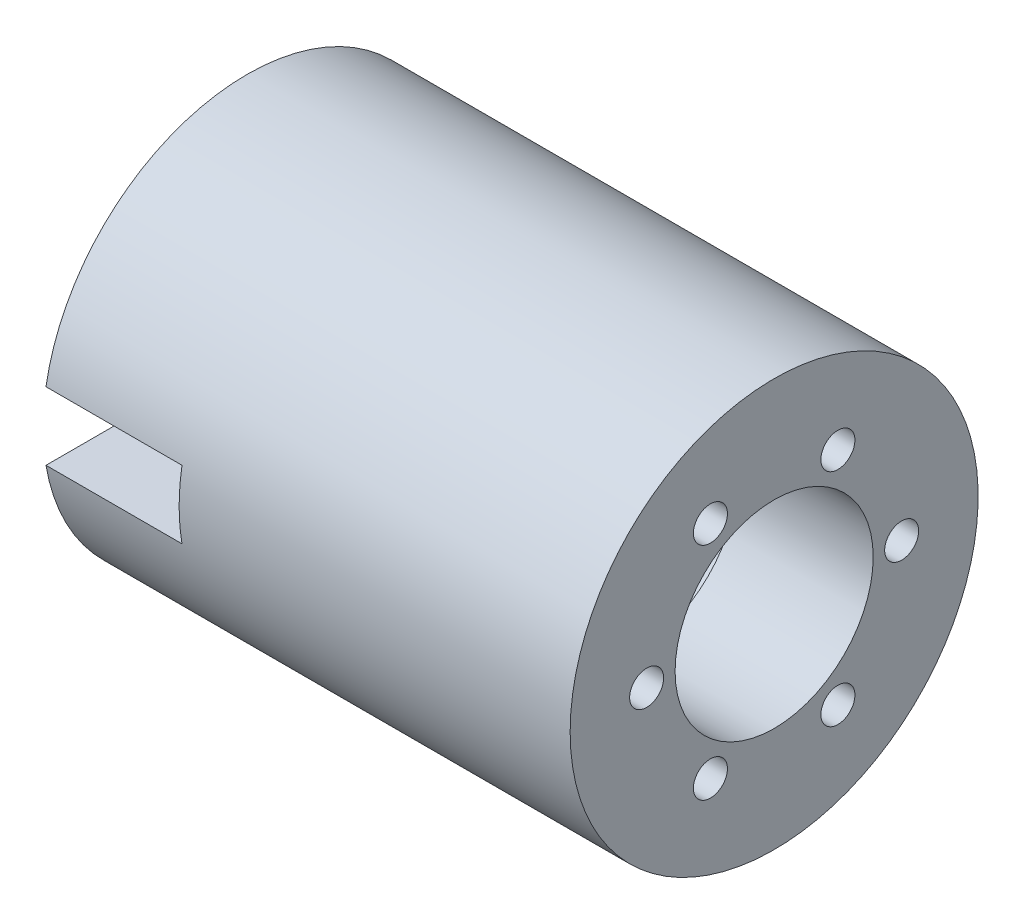
ISO-10303-21;
HEADER;
FILE_DESCRIPTION(('STEP AP214'),'2;1');
FILE_NAME('part.step','',(''),(''),'','','');
FILE_SCHEMA(('AUTOMOTIVE_DESIGN { 1 0 10303 214 1 1 1 1 }'));
ENDSEC;
DATA;
#1=APPLICATION_CONTEXT('core data for automotive mechanical design processes');
#2=APPLICATION_PROTOCOL_DEFINITION('international standard','automotive_design',2000,#1);
#3=PRODUCT_CONTEXT('',#1,'mechanical');
#4=PRODUCT('Part','Part','',(#3));
#5=PRODUCT_RELATED_PRODUCT_CATEGORY('part','',(#4));
#6=PRODUCT_DEFINITION_FORMATION('','',#4);
#7=PRODUCT_DEFINITION_CONTEXT('part definition',#1,'design');
#8=PRODUCT_DEFINITION('design','',#6,#7);
#9=PRODUCT_DEFINITION_SHAPE('','',#8);
#10=(LENGTH_UNIT() NAMED_UNIT(*) SI_UNIT(.MILLI.,.METRE.));
#11=(NAMED_UNIT(*) PLANE_ANGLE_UNIT() SI_UNIT($,.RADIAN.));
#12=(NAMED_UNIT(*) SI_UNIT($,.STERADIAN.) SOLID_ANGLE_UNIT());
#13=UNCERTAINTY_MEASURE_WITH_UNIT(LENGTH_MEASURE(1.E-05),#10,'distance_accuracy_value','');
#14=(GEOMETRIC_REPRESENTATION_CONTEXT(3) GLOBAL_UNCERTAINTY_ASSIGNED_CONTEXT((#13)) GLOBAL_UNIT_ASSIGNED_CONTEXT((#10,
#11,#12)) REPRESENTATION_CONTEXT('',''));
#15=CARTESIAN_POINT('',(0.,0.,0.));
#16=DIRECTION('',(0.,0.,1.));
#17=DIRECTION('',(1.,0.,0.));
#18=AXIS2_PLACEMENT_3D('',#15,#16,#17);
#19=CARTESIAN_POINT('',(-49.2125,0.,0.));
#20=DIRECTION('',(-1.,0.,0.));
#21=DIRECTION('',(0.,0.,1.));
#22=AXIS2_PLACEMENT_3D('',#19,#20,#21);
#23=CYLINDRICAL_SURFACE('',#22,38.1);
#24=CARTESIAN_POINT('',(49.2125,0.,0.));
#25=DIRECTION('',(-1.,0.,0.));
#26=DIRECTION('',(0.,0.,1.));
#27=AXIS2_PLACEMENT_3D('',#24,#25,#26);
#28=CIRCLE('',#27,38.1);
#29=CARTESIAN_POINT('',(49.2125,0.,38.1));
#30=VERTEX_POINT('',#29);
#31=EDGE_CURVE('E599',#30,#30,#28,.T.);
#32=ORIENTED_EDGE('',*,*,#31,.T.);
#33=EDGE_LOOP('',(#32));
#34=FACE_BOUND('',#33,.T.);
#35=CARTESIAN_POINT('',(-49.2125,0.,0.));
#36=DIRECTION('',(-1.,0.,0.));
#37=DIRECTION('',(0.,0.,1.));
#38=AXIS2_PLACEMENT_3D('',#35,#36,#37);
#39=CIRCLE('',#38,38.1);
#40=CARTESIAN_POINT('',(-49.2125,6.35,37.5671066226826));
#41=VERTEX_POINT('',#40);
#42=CARTESIAN_POINT('',(-49.2125,-6.35,37.5671066226826));
#43=VERTEX_POINT('',#42);
#44=EDGE_CURVE('E551',#41,#43,#39,.T.);
#45=ORIENTED_EDGE('',*,*,#44,.F.);
#46=DIRECTION('',(-1.,0.,0.));
#47=VECTOR('',#46,1.);
#48=CARTESIAN_POINT('',(-49.2125,6.35,37.5671066226826));
#49=LINE('',#48,#47);
#50=CARTESIAN_POINT('',(-23.8125,6.35,37.5671066226826));
#51=VERTEX_POINT('',#50);
#52=EDGE_CURVE('E544',#41,#51,#49,.F.);
#53=ORIENTED_EDGE('',*,*,#52,.T.);
#54=CARTESIAN_POINT('',(-23.8125,0.,0.));
#55=DIRECTION('',(-1.,0.,0.));
#56=DIRECTION('',(0.,-1.,0.));
#57=AXIS2_PLACEMENT_3D('',#54,#55,#56);
#58=CIRCLE('',#57,38.1);
#59=CARTESIAN_POINT('',(-23.8125,-6.34999999999998,37.5671066226826));
#60=VERTEX_POINT('',#59);
#61=EDGE_CURVE('E531',#51,#60,#58,.F.);
#62=ORIENTED_EDGE('',*,*,#61,.T.);
#63=DIRECTION('',(-1.,0.,0.));
#64=VECTOR('',#63,1.);
#65=CARTESIAN_POINT('',(-49.2125,-6.35,37.5671066226826));
#66=LINE('',#65,#64);
#67=EDGE_CURVE('E539',#60,#43,#66,.T.);
#68=ORIENTED_EDGE('',*,*,#67,.T.);
#69=EDGE_LOOP('',(#45,#53,#62,#68));
#70=FACE_BOUND('',#69,.T.);
#71=ADVANCED_FACE('F458',(#34,#70),#23,.T.);
#72=CARTESIAN_POINT('',(-49.2125,0.,0.));
#73=DIRECTION('',(-1.,0.,0.));
#74=DIRECTION('',(0.,0.,1.));
#75=AXIS2_PLACEMENT_3D('',#72,#73,#74);
#76=PLANE('',#75);
#77=CARTESIAN_POINT('',(-49.2125,0.,0.));
#78=DIRECTION('',(-1.,0.,0.));
#79=DIRECTION('',(0.,0.,1.));
#80=AXIS2_PLACEMENT_3D('',#77,#78,#79);
#81=CIRCLE('',#80,21.2725);
#82=CARTESIAN_POINT('',(-49.2125,6.35,20.3026292940102));
#83=VERTEX_POINT('',#82);
#84=CARTESIAN_POINT('',(-49.2125,-6.35,20.3026292940102));
#85=VERTEX_POINT('',#84);
#86=EDGE_CURVE('E609',#83,#85,#81,.T.);
#87=ORIENTED_EDGE('',*,*,#86,.F.);
#88=DIRECTION('',(0.,0.,-1.));
#89=VECTOR('',#88,1.);
#90=CARTESIAN_POINT('',(-49.2125,6.35,38.1));
#91=LINE('',#90,#89);
#92=EDGE_CURVE('E540',#41,#83,#91,.T.);
#93=ORIENTED_EDGE('',*,*,#92,.F.);
#94=ORIENTED_EDGE('',*,*,#44,.T.);
#95=DIRECTION('',(0.,0.,-1.));
#96=VECTOR('',#95,1.);
#97=CARTESIAN_POINT('',(-49.2125,-6.35,38.1));
#98=LINE('',#97,#96);
#99=EDGE_CURVE('E619',#43,#85,#98,.T.);
#100=ORIENTED_EDGE('',*,*,#99,.T.);
#101=EDGE_LOOP('',(#87,#93,#94,#100));
#102=FACE_BOUND('',#101,.T.);
#103=ADVANCED_FACE('F623',(#102),#76,.T.);
#104=CARTESIAN_POINT('',(-49.2125,0.,0.));
#105=DIRECTION('',(-1.,0.,0.));
#106=DIRECTION('',(0.,0.,1.));
#107=AXIS2_PLACEMENT_3D('',#104,#105,#106);
#108=CYLINDRICAL_SURFACE('',#107,21.2725);
#109=CARTESIAN_POINT('',(23.8125,0.,0.));
#110=DIRECTION('',(-1.,0.,0.));
#111=DIRECTION('',(0.,0.,1.));
#112=AXIS2_PLACEMENT_3D('',#109,#110,#111);
#113=CIRCLE('',#112,21.2725);
#114=CARTESIAN_POINT('',(23.8125,17.4570729607871,12.1560626804799));
#115=VERTEX_POINT('',#114);
#116=CARTESIAN_POINT('',(23.8125,19.2559955716851,9.04023731952017));
#117=VERTEX_POINT('',#116);
#118=EDGE_CURVE('E606',#115,#117,#113,.T.);
#119=ORIENTED_EDGE('',*,*,#118,.F.);
#120=CARTESIAN_POINT('',(23.8125,1.79892261089789,21.1963));
#121=VERTEX_POINT('',#120);
#122=EDGE_CURVE('E605',#121,#115,#113,.T.);
#123=ORIENTED_EDGE('',*,*,#122,.F.);
#124=CARTESIAN_POINT('',(23.8125,-1.79892261089803,21.1963));
#125=VERTEX_POINT('',#124);
#126=EDGE_CURVE('E892',#125,#121,#113,.T.);
#127=ORIENTED_EDGE('',*,*,#126,.F.);
#128=CARTESIAN_POINT('',(23.8125,-17.4570729607872,12.1560626804798));
#129=VERTEX_POINT('',#128);
#130=EDGE_CURVE('E896',#129,#125,#113,.T.);
#131=ORIENTED_EDGE('',*,*,#130,.F.);
#132=CARTESIAN_POINT('',(23.8125,-19.2559955716851,9.04023731952018));
#133=VERTEX_POINT('',#132);
#134=EDGE_CURVE('E929',#133,#129,#113,.T.);
#135=ORIENTED_EDGE('',*,*,#134,.F.);
#136=CARTESIAN_POINT('',(23.8125,-19.2559955716851,-9.04023731952019));
#137=VERTEX_POINT('',#136);
#138=EDGE_CURVE('E926',#137,#133,#113,.T.);
#139=ORIENTED_EDGE('',*,*,#138,.F.);
#140=CARTESIAN_POINT('',(23.8125,-17.4570729607871,-12.1560626804798));
#141=VERTEX_POINT('',#140);
#142=EDGE_CURVE('E923',#141,#137,#113,.T.);
#143=ORIENTED_EDGE('',*,*,#142,.F.);
#144=CARTESIAN_POINT('',(23.8125,-1.79892261089791,-21.1963));
#145=VERTEX_POINT('',#144);
#146=EDGE_CURVE('E920',#145,#141,#113,.T.);
#147=ORIENTED_EDGE('',*,*,#146,.F.);
#148=CARTESIAN_POINT('',(23.8125,1.79892261089791,-21.1963));
#149=VERTEX_POINT('',#148);
#150=EDGE_CURVE('E918',#149,#145,#113,.T.);
#151=ORIENTED_EDGE('',*,*,#150,.F.);
#152=CARTESIAN_POINT('',(23.8125,17.4570729607871,-12.15606268048));
#153=VERTEX_POINT('',#152);
#154=EDGE_CURVE('E917',#153,#149,#113,.T.);
#155=ORIENTED_EDGE('',*,*,#154,.F.);
#156=CARTESIAN_POINT('',(23.8125,19.2559955716851,-9.04023731952007));
#157=VERTEX_POINT('',#156);
#158=EDGE_CURVE('E915',#157,#153,#113,.T.);
#159=ORIENTED_EDGE('',*,*,#158,.F.);
#160=EDGE_CURVE('E610',#117,#157,#113,.T.);
#161=ORIENTED_EDGE('',*,*,#160,.F.);
#162=EDGE_LOOP('',(#119,#123,#127,#131,#135,#139,#143,#147,#151,#155,#159,#161));
#163=FACE_BOUND('',#162,.T.);
#164=DIRECTION('',(-1.,0.,0.));
#165=VECTOR('',#164,1.);
#166=CARTESIAN_POINT('',(-49.2125,6.35,20.3026292940102));
#167=LINE('',#166,#165);
#168=CARTESIAN_POINT('',(-23.8125,6.35,20.3026292940102));
#169=VERTEX_POINT('',#168);
#170=EDGE_CURVE('E12',#83,#169,#167,.F.);
#171=ORIENTED_EDGE('',*,*,#170,.F.);
#172=ORIENTED_EDGE('',*,*,#86,.T.);
#173=DIRECTION('',(-1.,0.,0.));
#174=VECTOR('',#173,1.);
#175=CARTESIAN_POINT('',(-49.2125,-6.35,20.3026292940102));
#176=LINE('',#175,#174);
#177=CARTESIAN_POINT('',(-23.8125,-6.34999999999998,20.3026292940102));
#178=VERTEX_POINT('',#177);
#179=EDGE_CURVE('E465',#178,#85,#176,.T.);
#180=ORIENTED_EDGE('',*,*,#179,.F.);
#181=CARTESIAN_POINT('',(-23.8125,0.,0.));
#182=DIRECTION('',(-1.,0.,0.));
#183=DIRECTION('',(0.,-1.,0.));
#184=AXIS2_PLACEMENT_3D('',#181,#182,#183);
#185=CIRCLE('',#184,21.2725);
#186=EDGE_CURVE('E614',#169,#178,#185,.F.);
#187=ORIENTED_EDGE('',*,*,#186,.F.);
#188=EDGE_LOOP('',(#171,#172,#180,#187));
#189=FACE_BOUND('',#188,.T.);
#190=ADVANCED_FACE('F625',(#163,#189),#108,.F.);
#191=CARTESIAN_POINT('',(23.8125,0.,0.));
#192=DIRECTION('',(1.,0.,0.));
#193=DIRECTION('',(0.,0.,-1.));
#194=AXIS2_PLACEMENT_3D('',#191,#192,#193);
#195=PLANE('',#194);
#196=CARTESIAN_POINT('',(23.8125,0.,0.));
#197=DIRECTION('',(1.,0.,0.));
#198=DIRECTION('',(0.,0.,-1.));
#199=AXIS2_PLACEMENT_3D('',#196,#197,#198);
#200=CIRCLE('',#199,18.5);
#201=CARTESIAN_POINT('',(23.8125,0.,-18.5));
#202=VERTEX_POINT('',#201);
#203=EDGE_CURVE('E560',#202,#202,#200,.T.);
#204=ORIENTED_EDGE('',*,*,#203,.T.);
#205=EDGE_LOOP('',(#204));
#206=FACE_BOUND('',#205,.T.);
#207=ORIENTED_EDGE('',*,*,#130,.T.);
#208=CARTESIAN_POINT('',(23.8125,0.,23.8125));
#209=DIRECTION('',(1.,0.,0.));
#210=DIRECTION('',(0.,0.86602540378444,-0.499999999999998));
#211=AXIS2_PLACEMENT_3D('',#208,#209,#210);
#212=CIRCLE('',#211,3.17499999999997);
#213=EDGE_CURVE('E558',#125,#121,#212,.T.);
#214=ORIENTED_EDGE('',*,*,#213,.T.);
#215=ORIENTED_EDGE('',*,*,#122,.T.);
#216=CARTESIAN_POINT('',(23.8125,20.6222299276169,11.90625));
#217=DIRECTION('',(1.,0.,0.));
#218=DIRECTION('',(0.,0.,-1.));
#219=AXIS2_PLACEMENT_3D('',#216,#217,#218);
#220=CIRCLE('',#219,3.17499999999997);
#221=EDGE_CURVE('E593',#115,#117,#220,.T.);
#222=ORIENTED_EDGE('',*,*,#221,.T.);
#223=ORIENTED_EDGE('',*,*,#160,.T.);
#224=CARTESIAN_POINT('',(23.8125,20.6222299276169,-11.90625));
#225=DIRECTION('',(1.,0.,0.));
#226=DIRECTION('',(0.,0.,-1.));
#227=AXIS2_PLACEMENT_3D('',#224,#225,#226);
#228=CIRCLE('',#227,3.17500000000002);
#229=EDGE_CURVE('E586',#157,#153,#228,.T.);
#230=ORIENTED_EDGE('',*,*,#229,.T.);
#231=ORIENTED_EDGE('',*,*,#154,.T.);
#232=CARTESIAN_POINT('',(23.8125,0.,-23.8125));
#233=DIRECTION('',(1.,0.,0.));
#234=DIRECTION('',(0.,0.,-1.));
#235=AXIS2_PLACEMENT_3D('',#232,#233,#234);
#236=CIRCLE('',#235,3.17499999999997);
#237=EDGE_CURVE('E579',#149,#145,#236,.T.);
#238=ORIENTED_EDGE('',*,*,#237,.T.);
#239=ORIENTED_EDGE('',*,*,#146,.T.);
#240=CARTESIAN_POINT('',(23.8125,-20.6222299276169,-11.90625));
#241=DIRECTION('',(1.,0.,0.));
#242=DIRECTION('',(0.,0.,-1.));
#243=AXIS2_PLACEMENT_3D('',#240,#241,#242);
#244=CIRCLE('',#243,3.17499999999997);
#245=EDGE_CURVE('E572',#141,#137,#244,.T.);
#246=ORIENTED_EDGE('',*,*,#245,.T.);
#247=ORIENTED_EDGE('',*,*,#138,.T.);
#248=CARTESIAN_POINT('',(23.8125,-20.6222299276169,11.90625));
#249=DIRECTION('',(1.,0.,0.));
#250=DIRECTION('',(0.,0.,-1.));
#251=AXIS2_PLACEMENT_3D('',#248,#249,#250);
#252=CIRCLE('',#251,3.17499999999997);
#253=EDGE_CURVE('E596',#133,#129,#252,.T.);
#254=ORIENTED_EDGE('',*,*,#253,.T.);
#255=EDGE_LOOP('',(#207,#214,#215,#222,#223,#230,#231,#238,#239,#246,#247,#254));
#256=FACE_BOUND('',#255,.T.);
#257=ADVANCED_FACE('F627',(#206,#256),#195,.F.);
#258=CARTESIAN_POINT('',(49.2125,0.,0.));
#259=DIRECTION('',(1.,0.,0.));
#260=DIRECTION('',(0.,0.,-1.));
#261=AXIS2_PLACEMENT_3D('',#258,#259,#260);
#262=PLANE('',#261);
#263=CARTESIAN_POINT('',(49.2125,0.,23.8125));
#264=DIRECTION('',(1.,0.,0.));
#265=DIRECTION('',(0.,0.86602540378444,-0.499999999999998));
#266=AXIS2_PLACEMENT_3D('',#263,#264,#265);
#267=CIRCLE('',#266,3.17499999999997);
#268=CARTESIAN_POINT('',(49.2125,2.7496306570155,22.225));
#269=VERTEX_POINT('',#268);
#270=EDGE_CURVE('E552',#269,#269,#267,.T.);
#271=ORIENTED_EDGE('',*,*,#270,.F.);
#272=EDGE_LOOP('',(#271));
#273=FACE_BOUND('',#272,.T.);
#274=CARTESIAN_POINT('',(49.2125,-20.6222299276169,-11.90625));
#275=DIRECTION('',(1.,0.,0.));
#276=DIRECTION('',(0.,0.,-1.));
#277=AXIS2_PLACEMENT_3D('',#274,#275,#276);
#278=CIRCLE('',#277,3.17499999999997);
#279=CARTESIAN_POINT('',(49.2125,-20.6222299276169,-15.08125));
#280=VERTEX_POINT('',#279);
#281=EDGE_CURVE('E568',#280,#280,#278,.T.);
#282=ORIENTED_EDGE('',*,*,#281,.F.);
#283=EDGE_LOOP('',(#282));
#284=FACE_BOUND('',#283,.T.);
#285=CARTESIAN_POINT('',(49.2125,0.,-23.8125));
#286=DIRECTION('',(1.,0.,0.));
#287=DIRECTION('',(0.,0.,-1.));
#288=AXIS2_PLACEMENT_3D('',#285,#286,#287);
#289=CIRCLE('',#288,3.17499999999997);
#290=CARTESIAN_POINT('',(49.2125,0.,-26.9875));
#291=VERTEX_POINT('',#290);
#292=EDGE_CURVE('E576',#291,#291,#289,.T.);
#293=ORIENTED_EDGE('',*,*,#292,.F.);
#294=EDGE_LOOP('',(#293));
#295=FACE_BOUND('',#294,.T.);
#296=CARTESIAN_POINT('',(49.2125,20.6222299276169,-11.90625));
#297=DIRECTION('',(1.,0.,0.));
#298=DIRECTION('',(0.,0.,-1.));
#299=AXIS2_PLACEMENT_3D('',#296,#297,#298);
#300=CIRCLE('',#299,3.17500000000002);
#301=CARTESIAN_POINT('',(49.2125,20.6222299276169,-15.08125));
#302=VERTEX_POINT('',#301);
#303=EDGE_CURVE('E583',#302,#302,#300,.T.);
#304=ORIENTED_EDGE('',*,*,#303,.F.);
#305=EDGE_LOOP('',(#304));
#306=FACE_BOUND('',#305,.T.);
#307=CARTESIAN_POINT('',(49.2125,20.6222299276169,11.90625));
#308=DIRECTION('',(1.,0.,0.));
#309=DIRECTION('',(0.,0.,-1.));
#310=AXIS2_PLACEMENT_3D('',#307,#308,#309);
#311=CIRCLE('',#310,3.17499999999997);
#312=CARTESIAN_POINT('',(49.2125,20.6222299276169,8.73125000000004));
#313=VERTEX_POINT('',#312);
#314=EDGE_CURVE('E590',#313,#313,#311,.T.);
#315=ORIENTED_EDGE('',*,*,#314,.F.);
#316=EDGE_LOOP('',(#315));
#317=FACE_BOUND('',#316,.T.);
#318=CARTESIAN_POINT('',(49.2125,0.,0.));
#319=DIRECTION('',(1.,0.,0.));
#320=DIRECTION('',(0.,0.,-1.));
#321=AXIS2_PLACEMENT_3D('',#318,#319,#320);
#322=CIRCLE('',#321,18.5);
#323=CARTESIAN_POINT('',(49.2125,0.,-18.5));
#324=VERTEX_POINT('',#323);
#325=EDGE_CURVE('E562',#324,#324,#322,.T.);
#326=ORIENTED_EDGE('',*,*,#325,.F.);
#327=EDGE_LOOP('',(#326));
#328=FACE_BOUND('',#327,.T.);
#329=CARTESIAN_POINT('',(49.2125,-20.6222299276169,11.90625));
#330=DIRECTION('',(1.,0.,0.));
#331=DIRECTION('',(0.,0.,-1.));
#332=AXIS2_PLACEMENT_3D('',#329,#330,#331);
#333=CIRCLE('',#332,3.17499999999997);
#334=CARTESIAN_POINT('',(49.2125,-20.6222299276169,8.73125000000004));
#335=VERTEX_POINT('',#334);
#336=EDGE_CURVE('E571',#335,#335,#333,.T.);
#337=ORIENTED_EDGE('',*,*,#336,.F.);
#338=EDGE_LOOP('',(#337));
#339=FACE_BOUND('',#338,.T.);
#340=ORIENTED_EDGE('',*,*,#31,.F.);
#341=EDGE_LOOP('',(#340));
#342=FACE_BOUND('',#341,.T.);
#343=ADVANCED_FACE('F634',(#273,#284,#295,#306,#317,#328,#339,#342),#262,.T.);
#344=CARTESIAN_POINT('',(23.8125,0.,0.));
#345=DIRECTION('',(1.,0.,0.));
#346=DIRECTION('',(0.,0.,-1.));
#347=AXIS2_PLACEMENT_3D('',#344,#345,#346);
#348=PLANE('',#347);
#349=ORIENTED_EDGE('',*,*,#134,.T.);
#350=EDGE_CURVE('E600',#129,#133,#252,.T.);
#351=ORIENTED_EDGE('',*,*,#350,.T.);
#352=EDGE_LOOP('',(#349,#351));
#353=FACE_BOUND('',#352,.T.);
#354=ADVANCED_FACE('F645',(#353),#348,.T.);
#355=CARTESIAN_POINT('',(23.8125,-20.6222299276169,11.90625));
#356=DIRECTION('',(1.,0.,0.));
#357=DIRECTION('',(0.,0.,-1.));
#358=AXIS2_PLACEMENT_3D('',#355,#356,#357);
#359=CYLINDRICAL_SURFACE('',#358,3.17499999999997);
#360=ORIENTED_EDGE('',*,*,#253,.F.);
#361=ORIENTED_EDGE('',*,*,#350,.F.);
#362=EDGE_LOOP('',(#360,#361));
#363=FACE_BOUND('',#362,.T.);
#364=ORIENTED_EDGE('',*,*,#336,.T.);
#365=EDGE_LOOP('',(#364));
#366=FACE_BOUND('',#365,.T.);
#367=ADVANCED_FACE('F651',(#363,#366),#359,.F.);
#368=CARTESIAN_POINT('',(23.8125,0.,0.));
#369=DIRECTION('',(1.,0.,0.));
#370=DIRECTION('',(0.,0.,-1.));
#371=AXIS2_PLACEMENT_3D('',#368,#369,#370);
#372=CYLINDRICAL_SURFACE('',#371,18.5);
#373=ORIENTED_EDGE('',*,*,#203,.F.);
#374=EDGE_LOOP('',(#373));
#375=FACE_BOUND('',#374,.T.);
#376=ORIENTED_EDGE('',*,*,#325,.T.);
#377=EDGE_LOOP('',(#376));
#378=FACE_BOUND('',#377,.T.);
#379=ADVANCED_FACE('F658',(#375,#378),#372,.F.);
#380=CARTESIAN_POINT('',(23.8125,0.,0.));
#381=DIRECTION('',(1.,0.,0.));
#382=DIRECTION('',(0.,0.,-1.));
#383=AXIS2_PLACEMENT_3D('',#380,#381,#382);
#384=PLANE('',#383);
#385=ORIENTED_EDGE('',*,*,#118,.T.);
#386=EDGE_CURVE('E565',#117,#115,#220,.T.);
#387=ORIENTED_EDGE('',*,*,#386,.T.);
#388=EDGE_LOOP('',(#385,#387));
#389=FACE_BOUND('',#388,.T.);
#390=ADVANCED_FACE('F661',(#389),#384,.T.);
#391=CARTESIAN_POINT('',(23.8125,20.6222299276169,11.90625));
#392=DIRECTION('',(1.,0.,0.));
#393=DIRECTION('',(0.,0.,-1.));
#394=AXIS2_PLACEMENT_3D('',#391,#392,#393);
#395=CYLINDRICAL_SURFACE('',#394,3.17499999999997);
#396=ORIENTED_EDGE('',*,*,#221,.F.);
#397=ORIENTED_EDGE('',*,*,#386,.F.);
#398=EDGE_LOOP('',(#396,#397));
#399=FACE_BOUND('',#398,.T.);
#400=ORIENTED_EDGE('',*,*,#314,.T.);
#401=EDGE_LOOP('',(#400));
#402=FACE_BOUND('',#401,.T.);
#403=ADVANCED_FACE('F664',(#399,#402),#395,.F.);
#404=CARTESIAN_POINT('',(23.8125,0.,0.));
#405=DIRECTION('',(1.,0.,0.));
#406=DIRECTION('',(0.,0.,-1.));
#407=AXIS2_PLACEMENT_3D('',#404,#405,#406);
#408=PLANE('',#407);
#409=ORIENTED_EDGE('',*,*,#158,.T.);
#410=EDGE_CURVE('E589',#153,#157,#228,.T.);
#411=ORIENTED_EDGE('',*,*,#410,.T.);
#412=EDGE_LOOP('',(#409,#411));
#413=FACE_BOUND('',#412,.T.);
#414=ADVANCED_FACE('F668',(#413),#408,.T.);
#415=CARTESIAN_POINT('',(23.8125,20.6222299276169,-11.90625));
#416=DIRECTION('',(1.,0.,0.));
#417=DIRECTION('',(0.,0.,-1.));
#418=AXIS2_PLACEMENT_3D('',#415,#416,#417);
#419=CYLINDRICAL_SURFACE('',#418,3.17500000000002);
#420=ORIENTED_EDGE('',*,*,#229,.F.);
#421=ORIENTED_EDGE('',*,*,#410,.F.);
#422=EDGE_LOOP('',(#420,#421));
#423=FACE_BOUND('',#422,.T.);
#424=ORIENTED_EDGE('',*,*,#303,.T.);
#425=EDGE_LOOP('',(#424));
#426=FACE_BOUND('',#425,.T.);
#427=ADVANCED_FACE('F672',(#423,#426),#419,.F.);
#428=CARTESIAN_POINT('',(23.8125,0.,0.));
#429=DIRECTION('',(1.,0.,0.));
#430=DIRECTION('',(0.,0.,-1.));
#431=AXIS2_PLACEMENT_3D('',#428,#429,#430);
#432=PLANE('',#431);
#433=ORIENTED_EDGE('',*,*,#150,.T.);
#434=EDGE_CURVE('E582',#145,#149,#236,.T.);
#435=ORIENTED_EDGE('',*,*,#434,.T.);
#436=EDGE_LOOP('',(#433,#435));
#437=FACE_BOUND('',#436,.T.);
#438=ADVANCED_FACE('F676',(#437),#432,.T.);
#439=CARTESIAN_POINT('',(23.8125,0.,-23.8125));
#440=DIRECTION('',(1.,0.,0.));
#441=DIRECTION('',(0.,0.,-1.));
#442=AXIS2_PLACEMENT_3D('',#439,#440,#441);
#443=CYLINDRICAL_SURFACE('',#442,3.17499999999997);
#444=ORIENTED_EDGE('',*,*,#237,.F.);
#445=ORIENTED_EDGE('',*,*,#434,.F.);
#446=EDGE_LOOP('',(#444,#445));
#447=FACE_BOUND('',#446,.T.);
#448=ORIENTED_EDGE('',*,*,#292,.T.);
#449=EDGE_LOOP('',(#448));
#450=FACE_BOUND('',#449,.T.);
#451=ADVANCED_FACE('F680',(#447,#450),#443,.F.);
#452=CARTESIAN_POINT('',(23.8125,0.,0.));
#453=DIRECTION('',(1.,0.,0.));
#454=DIRECTION('',(0.,0.,-1.));
#455=AXIS2_PLACEMENT_3D('',#452,#453,#454);
#456=PLANE('',#455);
#457=ORIENTED_EDGE('',*,*,#142,.T.);
#458=EDGE_CURVE('E575',#137,#141,#244,.T.);
#459=ORIENTED_EDGE('',*,*,#458,.T.);
#460=EDGE_LOOP('',(#457,#459));
#461=FACE_BOUND('',#460,.T.);
#462=ADVANCED_FACE('F684',(#461),#456,.T.);
#463=CARTESIAN_POINT('',(23.8125,-20.6222299276169,-11.90625));
#464=DIRECTION('',(1.,0.,0.));
#465=DIRECTION('',(0.,0.,-1.));
#466=AXIS2_PLACEMENT_3D('',#463,#464,#465);
#467=CYLINDRICAL_SURFACE('',#466,3.17499999999997);
#468=ORIENTED_EDGE('',*,*,#245,.F.);
#469=ORIENTED_EDGE('',*,*,#458,.F.);
#470=EDGE_LOOP('',(#468,#469));
#471=FACE_BOUND('',#470,.T.);
#472=ORIENTED_EDGE('',*,*,#281,.T.);
#473=EDGE_LOOP('',(#472));
#474=FACE_BOUND('',#473,.T.);
#475=ADVANCED_FACE('F688',(#471,#474),#467,.F.);
#476=CARTESIAN_POINT('',(23.8125,0.,0.));
#477=DIRECTION('',(1.,0.,0.));
#478=DIRECTION('',(0.,0.86602540378444,-0.499999999999998));
#479=AXIS2_PLACEMENT_3D('',#476,#477,#478);
#480=PLANE('',#479);
#481=ORIENTED_EDGE('',*,*,#126,.T.);
#482=EDGE_CURVE('E478',#121,#125,#212,.T.);
#483=ORIENTED_EDGE('',*,*,#482,.T.);
#484=EDGE_LOOP('',(#481,#483));
#485=FACE_BOUND('',#484,.T.);
#486=ADVANCED_FACE('F692',(#485),#480,.T.);
#487=CARTESIAN_POINT('',(23.8125,0.,23.8125));
#488=DIRECTION('',(1.,0.,0.));
#489=DIRECTION('',(0.,0.,-1.));
#490=AXIS2_PLACEMENT_3D('',#487,#488,#489);
#491=CYLINDRICAL_SURFACE('',#490,3.17499999999997);
#492=ORIENTED_EDGE('',*,*,#213,.F.);
#493=ORIENTED_EDGE('',*,*,#482,.F.);
#494=EDGE_LOOP('',(#492,#493));
#495=FACE_BOUND('',#494,.T.);
#496=ORIENTED_EDGE('',*,*,#270,.T.);
#497=EDGE_LOOP('',(#496));
#498=FACE_BOUND('',#497,.T.);
#499=ADVANCED_FACE('F697',(#495,#498),#491,.F.);
#500=CARTESIAN_POINT('',(-49.2125,6.35,38.1));
#501=DIRECTION('',(0.,-1.,0.));
#502=DIRECTION('',(0.,0.,-1.));
#503=AXIS2_PLACEMENT_3D('',#500,#501,#502);
#504=PLANE('',#503);
#505=ORIENTED_EDGE('',*,*,#92,.T.);
#506=ORIENTED_EDGE('',*,*,#170,.T.);
#507=DIRECTION('',(0.,0.,-1.));
#508=VECTOR('',#507,1.);
#509=CARTESIAN_POINT('',(-23.8125,6.35,38.1));
#510=LINE('',#509,#508);
#511=EDGE_CURVE('E472',#51,#169,#510,.T.);
#512=ORIENTED_EDGE('',*,*,#511,.F.);
#513=ORIENTED_EDGE('',*,*,#52,.F.);
#514=EDGE_LOOP('',(#505,#506,#512,#513));
#515=FACE_BOUND('',#514,.T.);
#516=ADVANCED_FACE('F543',(#515),#504,.T.);
#517=CARTESIAN_POINT('',(-23.8125,-6.34999999999998,38.1));
#518=DIRECTION('',(0.,1.,0.));
#519=DIRECTION('',(-1.,0.,0.));
#520=AXIS2_PLACEMENT_3D('',#517,#518,#519);
#521=PLANE('',#520);
#522=DIRECTION('',(0.,0.,-1.));
#523=VECTOR('',#522,1.);
#524=CARTESIAN_POINT('',(-23.8125,-6.34999999999998,38.1));
#525=LINE('',#524,#523);
#526=EDGE_CURVE('E534',#60,#178,#525,.T.);
#527=ORIENTED_EDGE('',*,*,#526,.T.);
#528=ORIENTED_EDGE('',*,*,#179,.T.);
#529=ORIENTED_EDGE('',*,*,#99,.F.);
#530=ORIENTED_EDGE('',*,*,#67,.F.);
#531=EDGE_LOOP('',(#527,#528,#529,#530));
#532=FACE_BOUND('',#531,.T.);
#533=ADVANCED_FACE('F618',(#532),#521,.T.);
#534=CARTESIAN_POINT('',(-23.8125,6.35,38.1));
#535=DIRECTION('',(-1.,0.,0.));
#536=DIRECTION('',(0.,-1.,0.));
#537=AXIS2_PLACEMENT_3D('',#534,#535,#536);
#538=PLANE('',#537);
#539=ORIENTED_EDGE('',*,*,#511,.T.);
#540=ORIENTED_EDGE('',*,*,#186,.T.);
#541=ORIENTED_EDGE('',*,*,#526,.F.);
#542=ORIENTED_EDGE('',*,*,#61,.F.);
#543=EDGE_LOOP('',(#539,#540,#541,#542));
#544=FACE_BOUND('',#543,.T.);
#545=ADVANCED_FACE('F532',(#544),#538,.T.);
#546=CLOSED_SHELL('',(#71,#103,#190,#257,#343,#354,#367,#379,#390,#403,#414,#427,#438,#451,#462,
#475,#486,#499,#516,#533,#545));
#547=MANIFOLD_SOLID_BREP('B2',#546);
#548=ADVANCED_BREP_SHAPE_REPRESENTATION('',(#18,#547),#14);
#549=SHAPE_DEFINITION_REPRESENTATION(#9,#548);
ENDSEC;
END-ISO-10303-21;
